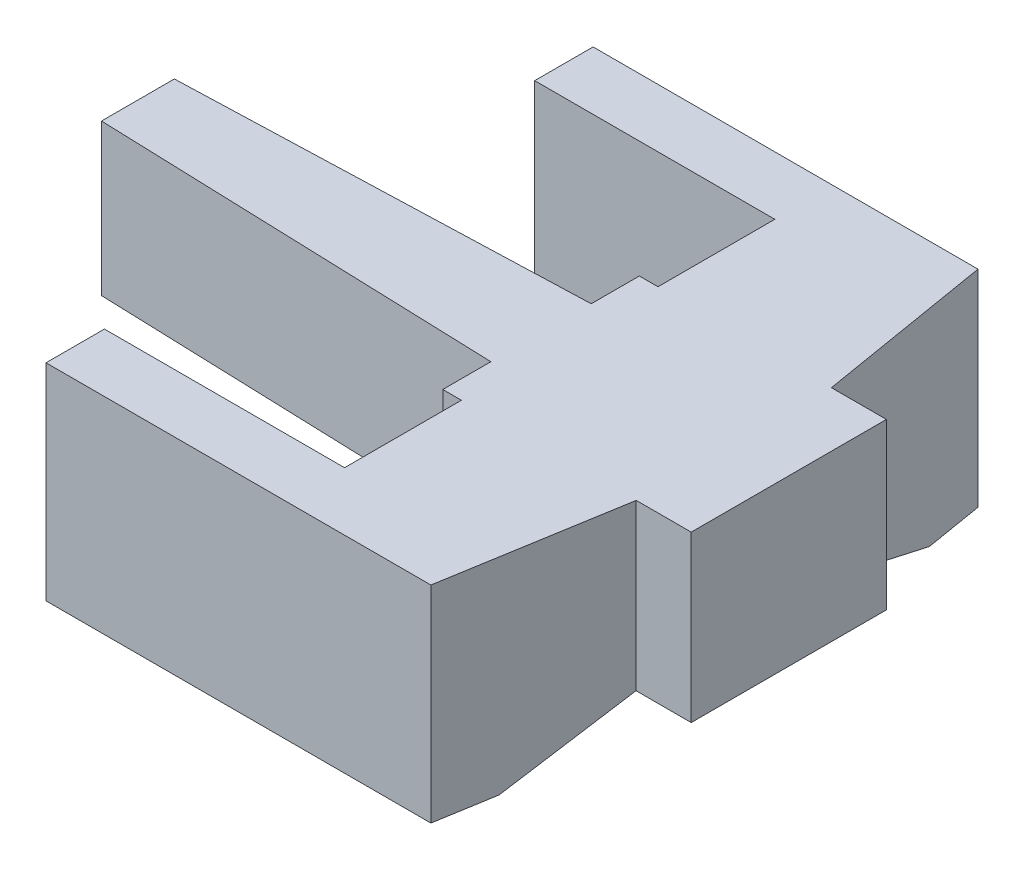
ISO-10303-21;
HEADER;
FILE_DESCRIPTION(('STEP AP214'),'2;1');
FILE_NAME('part.step','',(''),(''),'','','');
FILE_SCHEMA(('AUTOMOTIVE_DESIGN { 1 0 10303 214 1 1 1 1 }'));
ENDSEC;
DATA;
#1=APPLICATION_CONTEXT('core data for automotive mechanical design processes');
#2=APPLICATION_PROTOCOL_DEFINITION('international standard','automotive_design',2000,#1);
#3=PRODUCT_CONTEXT('',#1,'mechanical');
#4=PRODUCT('Part','Part','',(#3));
#5=PRODUCT_RELATED_PRODUCT_CATEGORY('part','',(#4));
#6=PRODUCT_DEFINITION_FORMATION('','',#4);
#7=PRODUCT_DEFINITION_CONTEXT('part definition',#1,'design');
#8=PRODUCT_DEFINITION('design','',#6,#7);
#9=PRODUCT_DEFINITION_SHAPE('','',#8);
#10=(LENGTH_UNIT() NAMED_UNIT(*) SI_UNIT(.MILLI.,.METRE.));
#11=(NAMED_UNIT(*) PLANE_ANGLE_UNIT() SI_UNIT($,.RADIAN.));
#12=(NAMED_UNIT(*) SI_UNIT($,.STERADIAN.) SOLID_ANGLE_UNIT());
#13=UNCERTAINTY_MEASURE_WITH_UNIT(LENGTH_MEASURE(1.E-05),#10,'distance_accuracy_value','');
#14=(GEOMETRIC_REPRESENTATION_CONTEXT(3) GLOBAL_UNCERTAINTY_ASSIGNED_CONTEXT((#13)) GLOBAL_UNIT_ASSIGNED_CONTEXT((#10,
#11,#12)) REPRESENTATION_CONTEXT('',''));
#15=CARTESIAN_POINT('',(0.,0.,0.));
#16=DIRECTION('',(0.,0.,1.));
#17=DIRECTION('',(1.,0.,0.));
#18=AXIS2_PLACEMENT_3D('',#15,#16,#17);
#19=CARTESIAN_POINT('',(12.0186614655194,15.,-76.3129094407043));
#20=DIRECTION('',(0.0340792834650468,0.,0.999419132515737));
#21=DIRECTION('',(0.999419132515737,0.,-0.0340792834650468));
#22=AXIS2_PLACEMENT_3D('',#19,#20,#21);
#23=PLANE('',#22);
#24=DIRECTION('',(0.999419132515737,0.,-0.0340792834650468));
#25=VECTOR('',#24,1.);
#26=CARTESIAN_POINT('',(41.3449568244222,4.,-77.3129094407043));
#27=LINE('',#26,#25);
#28=CARTESIAN_POINT('',(12.0186614655194,4.,-76.3129094407043));
#29=VERTEX_POINT('',#28);
#30=CARTESIAN_POINT('',(41.3449568244222,4.,-77.3129094407043));
#31=VERTEX_POINT('',#30);
#32=EDGE_CURVE('E392',#29,#31,#27,.T.);
#33=ORIENTED_EDGE('',*,*,#32,.F.);
#34=DIRECTION('',(0.,-1.,0.));
#35=VECTOR('',#34,1.);
#36=CARTESIAN_POINT('',(12.0186614655194,15.,-76.3129094407043));
#37=LINE('',#36,#35);
#38=CARTESIAN_POINT('',(12.0186614655194,15.,-76.3129094407043));
#39=VERTEX_POINT('',#38);
#40=EDGE_CURVE('E218',#39,#29,#37,.T.);
#41=ORIENTED_EDGE('',*,*,#40,.F.);
#42=DIRECTION('',(-0.999419132515737,0.,0.0340792834650468));
#43=VECTOR('',#42,1.);
#44=CARTESIAN_POINT('',(12.0186614655194,15.,-76.3129094407043));
#45=LINE('',#44,#43);
#46=CARTESIAN_POINT('',(41.3449568244222,15.,-77.3129094407043));
#47=VERTEX_POINT('',#46);
#48=EDGE_CURVE('E302',#47,#39,#45,.T.);
#49=ORIENTED_EDGE('',*,*,#48,.F.);
#50=DIRECTION('',(0.,-1.,0.));
#51=VECTOR('',#50,1.);
#52=CARTESIAN_POINT('',(41.3449568244222,15.,-77.3129094407043));
#53=LINE('',#52,#51);
#54=EDGE_CURVE('E221',#47,#31,#53,.T.);
#55=ORIENTED_EDGE('',*,*,#54,.T.);
#56=EDGE_LOOP('',(#33,#41,#49,#55));
#57=FACE_BOUND('',#56,.T.);
#58=ADVANCED_FACE('F33',(#57),#23,.F.);
#59=CARTESIAN_POINT('',(12.0186614655193,15.,-71.0129094407043));
#60=DIRECTION('',(1.,0.,0.));
#61=DIRECTION('',(0.,0.,-1.));
#62=AXIS2_PLACEMENT_3D('',#59,#60,#61);
#63=PLANE('',#62);
#64=DIRECTION('',(0.,0.,-1.));
#65=VECTOR('',#64,1.);
#66=CARTESIAN_POINT('',(12.0186614655194,4.,-76.3129094407043));
#67=LINE('',#66,#65);
#68=CARTESIAN_POINT('',(12.0186614655193,4.,-71.0129094407043));
#69=VERTEX_POINT('',#68);
#70=EDGE_CURVE('E397',#69,#29,#67,.T.);
#71=ORIENTED_EDGE('',*,*,#70,.F.);
#72=DIRECTION('',(0.,-1.,0.));
#73=VECTOR('',#72,1.);
#74=CARTESIAN_POINT('',(12.0186614655193,15.,-71.0129094407043));
#75=LINE('',#74,#73);
#76=CARTESIAN_POINT('',(12.0186614655193,15.,-71.0129094407043));
#77=VERTEX_POINT('',#76);
#78=EDGE_CURVE('E215',#77,#69,#75,.T.);
#79=ORIENTED_EDGE('',*,*,#78,.F.);
#80=DIRECTION('',(0.,0.,1.));
#81=VECTOR('',#80,1.);
#82=CARTESIAN_POINT('',(12.0186614655193,15.,-71.0129094407043));
#83=LINE('',#82,#81);
#84=EDGE_CURVE('E304',#39,#77,#83,.T.);
#85=ORIENTED_EDGE('',*,*,#84,.F.);
#86=ORIENTED_EDGE('',*,*,#40,.T.);
#87=EDGE_LOOP('',(#71,#79,#85,#86));
#88=FACE_BOUND('',#87,.T.);
#89=ADVANCED_FACE('F469',(#88),#63,.F.);
#90=CARTESIAN_POINT('',(41.3449568244222,15.,-70.0129094407043));
#91=DIRECTION('',(0.0340792834650473,0.,-0.999419132515737));
#92=DIRECTION('',(-0.999419132515737,0.,-0.0340792834650473));
#93=AXIS2_PLACEMENT_3D('',#90,#91,#92);
#94=PLANE('',#93);
#95=DIRECTION('',(-0.999419132515737,0.,-0.0340792834650473));
#96=VECTOR('',#95,1.);
#97=CARTESIAN_POINT('',(12.0186614655193,4.,-71.0129094407043));
#98=LINE('',#97,#96);
#99=CARTESIAN_POINT('',(41.3449568244222,4.,-70.0129094407043));
#100=VERTEX_POINT('',#99);
#101=EDGE_CURVE('E421',#100,#69,#98,.T.);
#102=ORIENTED_EDGE('',*,*,#101,.F.);
#103=DIRECTION('',(0.,-1.,0.));
#104=VECTOR('',#103,1.);
#105=CARTESIAN_POINT('',(41.3449568244222,15.,-70.0129094407043));
#106=LINE('',#105,#104);
#107=CARTESIAN_POINT('',(41.3449568244222,15.,-70.0129094407043));
#108=VERTEX_POINT('',#107);
#109=EDGE_CURVE('E212',#108,#100,#106,.T.);
#110=ORIENTED_EDGE('',*,*,#109,.F.);
#111=DIRECTION('',(0.999419132515737,0.,0.0340792834650473));
#112=VECTOR('',#111,1.);
#113=CARTESIAN_POINT('',(41.3449568244222,15.,-70.0129094407043));
#114=LINE('',#113,#112);
#115=EDGE_CURVE('E306',#77,#108,#114,.T.);
#116=ORIENTED_EDGE('',*,*,#115,.F.);
#117=ORIENTED_EDGE('',*,*,#78,.T.);
#118=EDGE_LOOP('',(#102,#110,#116,#117));
#119=FACE_BOUND('',#118,.T.);
#120=ADVANCED_FACE('F471',(#119),#94,.F.);
#121=CARTESIAN_POINT('',(41.3449568244222,15.,-80.8129094407043));
#122=DIRECTION('',(0.,0.,1.));
#123=DIRECTION('',(1.,0.,0.));
#124=AXIS2_PLACEMENT_3D('',#121,#122,#123);
#125=PLANE('',#124);
#126=DIRECTION('',(1.,0.,0.));
#127=VECTOR('',#126,1.);
#128=CARTESIAN_POINT('',(42.7011333168489,3.,-80.8129094407043));
#129=LINE('',#128,#127);
#130=CARTESIAN_POINT('',(41.3449568244222,3.,-80.8129094407043));
#131=VERTEX_POINT('',#130);
#132=CARTESIAN_POINT('',(42.7011333168488,3.,-80.8129094407043));
#133=VERTEX_POINT('',#132);
#134=EDGE_CURVE('E269',#131,#133,#129,.T.);
#135=ORIENTED_EDGE('',*,*,#134,.F.);
#136=DIRECTION('',(0.,-1.,0.));
#137=VECTOR('',#136,1.);
#138=CARTESIAN_POINT('',(41.3449568244222,15.,-80.8129094407043));
#139=LINE('',#138,#137);
#140=CARTESIAN_POINT('',(41.3449568244222,15.,-80.8129094407043));
#141=VERTEX_POINT('',#140);
#142=EDGE_CURVE('E224',#141,#131,#139,.T.);
#143=ORIENTED_EDGE('',*,*,#142,.F.);
#144=DIRECTION('',(-1.,0.,0.));
#145=VECTOR('',#144,1.);
#146=CARTESIAN_POINT('',(41.3449568244222,15.,-80.8129094407043));
#147=LINE('',#146,#145);
#148=CARTESIAN_POINT('',(42.7011333168489,15.,-80.8129094407043));
#149=VERTEX_POINT('',#148);
#150=EDGE_CURVE('E298',#149,#141,#147,.T.);
#151=ORIENTED_EDGE('',*,*,#150,.F.);
#152=DIRECTION('',(0.,-1.,0.));
#153=VECTOR('',#152,1.);
#154=CARTESIAN_POINT('',(42.7011333168489,15.,-80.8129094407043));
#155=LINE('',#154,#153);
#156=EDGE_CURVE('E227',#149,#133,#155,.T.);
#157=ORIENTED_EDGE('',*,*,#156,.T.);
#158=EDGE_LOOP('',(#135,#143,#151,#157));
#159=FACE_BOUND('',#158,.T.);
#160=ADVANCED_FACE('F407',(#159),#125,.F.);
#161=CARTESIAN_POINT('',(41.3449568244222,15.,-77.3129094407043));
#162=DIRECTION('',(1.,0.,0.));
#163=DIRECTION('',(0.,0.,-1.));
#164=AXIS2_PLACEMENT_3D('',#161,#162,#163);
#165=PLANE('',#164);
#166=DIRECTION('',(0.,0.,-1.));
#167=VECTOR('',#166,1.);
#168=CARTESIAN_POINT('',(41.3449568244222,3.,-77.3129094407043));
#169=LINE('',#168,#167);
#170=CARTESIAN_POINT('',(41.3449568244222,3.,-75.763096413664));
#171=VERTEX_POINT('',#170);
#172=EDGE_CURVE('E282',#171,#131,#169,.T.);
#173=ORIENTED_EDGE('',*,*,#172,.F.);
#174=DIRECTION('',(0.,-1.,0.));
#175=VECTOR('',#174,1.);
#176=CARTESIAN_POINT('',(41.3449568244222,4.,-75.763096413664));
#177=LINE('',#176,#175);
#178=CARTESIAN_POINT('',(41.3449568244222,4.,-75.763096413664));
#179=VERTEX_POINT('',#178);
#180=EDGE_CURVE('E387',#179,#171,#177,.T.);
#181=ORIENTED_EDGE('',*,*,#180,.F.);
#182=DIRECTION('',(0.,0.,1.));
#183=VECTOR('',#182,1.);
#184=CARTESIAN_POINT('',(41.3449568244222,4.,-77.3129094407043));
#185=LINE('',#184,#183);
#186=EDGE_CURVE('E381',#31,#179,#185,.T.);
#187=ORIENTED_EDGE('',*,*,#186,.F.);
#188=ORIENTED_EDGE('',*,*,#54,.F.);
#189=DIRECTION('',(0.,0.,1.));
#190=VECTOR('',#189,1.);
#191=CARTESIAN_POINT('',(41.3449568244222,15.,-77.3129094407043));
#192=LINE('',#191,#190);
#193=EDGE_CURVE('E300',#141,#47,#192,.T.);
#194=ORIENTED_EDGE('',*,*,#193,.F.);
#195=ORIENTED_EDGE('',*,*,#142,.T.);
#196=EDGE_LOOP('',(#173,#181,#187,#188,#194,#195));
#197=FACE_BOUND('',#196,.T.);
#198=ADVANCED_FACE('F383',(#197),#165,.F.);
#199=CARTESIAN_POINT('',(41.3449568244222,15.,-66.5129094407043));
#200=DIRECTION('',(1.,0.,0.));
#201=DIRECTION('',(0.,0.,-1.));
#202=AXIS2_PLACEMENT_3D('',#199,#200,#201);
#203=PLANE('',#202);
#204=DIRECTION('',(0.,0.,-1.));
#205=VECTOR('',#204,1.);
#206=CARTESIAN_POINT('',(41.3449568244222,3.,-66.5129094407043));
#207=LINE('',#206,#205);
#208=CARTESIAN_POINT('',(41.3449568244222,3.,-66.5129094407039));
#209=VERTEX_POINT('',#208);
#210=CARTESIAN_POINT('',(41.3449568244222,3.,-71.5627224677447));
#211=VERTEX_POINT('',#210);
#212=EDGE_CURVE('E276',#209,#211,#207,.T.);
#213=ORIENTED_EDGE('',*,*,#212,.F.);
#214=DIRECTION('',(0.,-1.,0.));
#215=VECTOR('',#214,1.);
#216=CARTESIAN_POINT('',(41.3449568244222,15.,-66.5129094407043));
#217=LINE('',#216,#215);
#218=CARTESIAN_POINT('',(41.3449568244222,15.,-66.5129094407043));
#219=VERTEX_POINT('',#218);
#220=EDGE_CURVE('E209',#219,#209,#217,.T.);
#221=ORIENTED_EDGE('',*,*,#220,.F.);
#222=DIRECTION('',(0.,0.,1.));
#223=VECTOR('',#222,1.);
#224=CARTESIAN_POINT('',(41.3449568244222,15.,-66.5129094407043));
#225=LINE('',#224,#223);
#226=EDGE_CURVE('E308',#108,#219,#225,.T.);
#227=ORIENTED_EDGE('',*,*,#226,.F.);
#228=ORIENTED_EDGE('',*,*,#109,.T.);
#229=DIRECTION('',(0.,0.,1.));
#230=VECTOR('',#229,1.);
#231=CARTESIAN_POINT('',(41.3449568244222,4.,-70.0129094407043));
#232=LINE('',#231,#230);
#233=CARTESIAN_POINT('',(41.3449568244222,4.,-71.5627224677447));
#234=VERTEX_POINT('',#233);
#235=EDGE_CURVE('E461',#234,#100,#232,.T.);
#236=ORIENTED_EDGE('',*,*,#235,.F.);
#237=DIRECTION('',(0.,-1.,0.));
#238=VECTOR('',#237,1.);
#239=CARTESIAN_POINT('',(41.3449568244222,4.,-71.5627224677447));
#240=LINE('',#239,#238);
#241=EDGE_CURVE('E416',#234,#211,#240,.T.);
#242=ORIENTED_EDGE('',*,*,#241,.T.);
#243=EDGE_LOOP('',(#213,#221,#227,#228,#236,#242));
#244=FACE_BOUND('',#243,.T.);
#245=ADVANCED_FACE('F459',(#244),#203,.F.);
#246=CARTESIAN_POINT('',(59.3686614655194,15.,-66.5629094407043));
#247=DIRECTION('',(0.,0.,-1.));
#248=DIRECTION('',(-1.,0.,0.));
#249=AXIS2_PLACEMENT_3D('',#246,#247,#248);
#250=PLANE('',#249);
#251=DIRECTION('',(-1.,0.,0.));
#252=VECTOR('',#251,1.);
#253=CARTESIAN_POINT('',(59.3686614655194,3.,-66.5629094407043));
#254=LINE('',#253,#252);
#255=CARTESIAN_POINT('',(59.3686614655194,3.,-66.5629094407043));
#256=VERTEX_POINT('',#255);
#257=CARTESIAN_POINT('',(55.3686614655194,3.,-66.5629094407043));
#258=VERTEX_POINT('',#257);
#259=EDGE_CURVE('E285',#256,#258,#254,.T.);
#260=ORIENTED_EDGE('',*,*,#259,.F.);
#261=DIRECTION('',(0.,-1.,0.));
#262=VECTOR('',#261,1.);
#263=CARTESIAN_POINT('',(59.3686614655194,15.,-66.5629094407043));
#264=LINE('',#263,#262);
#265=CARTESIAN_POINT('',(59.3686614655194,15.,-66.5629094407043));
#266=VERTEX_POINT('',#265);
#267=EDGE_CURVE('E161',#266,#256,#264,.T.);
#268=ORIENTED_EDGE('',*,*,#267,.F.);
#269=DIRECTION('',(1.,0.,0.));
#270=VECTOR('',#269,1.);
#271=CARTESIAN_POINT('',(59.3686614655194,15.,-66.5629094407043));
#272=LINE('',#271,#270);
#273=CARTESIAN_POINT('',(55.3686614655194,15.,-66.5629094407043));
#274=VERTEX_POINT('',#273);
#275=EDGE_CURVE('E147',#274,#266,#272,.T.);
#276=ORIENTED_EDGE('',*,*,#275,.F.);
#277=DIRECTION('',(0.,-1.,0.));
#278=VECTOR('',#277,1.);
#279=CARTESIAN_POINT('',(55.3686614655194,15.,-66.5629094407043));
#280=LINE('',#279,#278);
#281=EDGE_CURVE('E193',#274,#258,#280,.T.);
#282=ORIENTED_EDGE('',*,*,#281,.T.);
#283=EDGE_LOOP('',(#260,#268,#276,#282));
#284=FACE_BOUND('',#283,.T.);
#285=ADVANCED_FACE('F330',(#284),#250,.F.);
#286=CARTESIAN_POINT('',(59.3686614655194,15.,-80.7629094407043));
#287=DIRECTION('',(-1.,0.,0.));
#288=DIRECTION('',(0.,0.,1.));
#289=AXIS2_PLACEMENT_3D('',#286,#287,#288);
#290=PLANE('',#289);
#291=DIRECTION('',(0.,0.,1.));
#292=VECTOR('',#291,1.);
#293=CARTESIAN_POINT('',(59.3686614655194,3.,-80.7629094407043));
#294=LINE('',#293,#292);
#295=CARTESIAN_POINT('',(59.3686614655194,3.,-80.7629094407043));
#296=VERTEX_POINT('',#295);
#297=EDGE_CURVE('E158',#296,#256,#294,.T.);
#298=ORIENTED_EDGE('',*,*,#297,.F.);
#299=DIRECTION('',(0.,-1.,0.));
#300=VECTOR('',#299,1.);
#301=CARTESIAN_POINT('',(59.3686614655194,15.,-80.7629094407043));
#302=LINE('',#301,#300);
#303=CARTESIAN_POINT('',(59.3686614655194,15.,-80.7629094407043));
#304=VERTEX_POINT('',#303);
#305=EDGE_CURVE('E154',#304,#296,#302,.T.);
#306=ORIENTED_EDGE('',*,*,#305,.F.);
#307=DIRECTION('',(0.,0.,-1.));
#308=VECTOR('',#307,1.);
#309=CARTESIAN_POINT('',(59.3686614655194,15.,-80.7629094407043));
#310=LINE('',#309,#308);
#311=EDGE_CURVE('E140',#266,#304,#310,.T.);
#312=ORIENTED_EDGE('',*,*,#311,.F.);
#313=ORIENTED_EDGE('',*,*,#267,.T.);
#314=EDGE_LOOP('',(#298,#306,#312,#313));
#315=FACE_BOUND('',#314,.T.);
#316=ADVANCED_FACE('F155',(#315),#290,.F.);
#317=CARTESIAN_POINT('',(55.3686614655194,15.,-80.7629094407043));
#318=DIRECTION('',(0.,0.,1.));
#319=DIRECTION('',(1.,0.,0.));
#320=AXIS2_PLACEMENT_3D('',#317,#318,#319);
#321=PLANE('',#320);
#322=DIRECTION('',(1.,0.,0.));
#323=VECTOR('',#322,1.);
#324=CARTESIAN_POINT('',(55.3686614655194,3.,-80.7629094407043));
#325=LINE('',#324,#323);
#326=CARTESIAN_POINT('',(55.3686614655194,3.,-80.7629094407043));
#327=VERTEX_POINT('',#326);
#328=EDGE_CURVE('E272',#327,#296,#325,.T.);
#329=ORIENTED_EDGE('',*,*,#328,.F.);
#330=DIRECTION('',(0.,-1.,0.));
#331=VECTOR('',#330,1.);
#332=CARTESIAN_POINT('',(55.3686614655194,15.,-80.7629094407043));
#333=LINE('',#332,#331);
#334=CARTESIAN_POINT('',(55.3686614655194,15.,-80.7629094407043));
#335=VERTEX_POINT('',#334);
#336=EDGE_CURVE('E162',#335,#327,#333,.T.);
#337=ORIENTED_EDGE('',*,*,#336,.F.);
#338=DIRECTION('',(-1.,0.,0.));
#339=VECTOR('',#338,1.);
#340=CARTESIAN_POINT('',(55.3686614655194,15.,-80.7629094407043));
#341=LINE('',#340,#339);
#342=EDGE_CURVE('E144',#304,#335,#341,.T.);
#343=ORIENTED_EDGE('',*,*,#342,.F.);
#344=ORIENTED_EDGE('',*,*,#305,.T.);
#345=EDGE_LOOP('',(#329,#337,#343,#344));
#346=FACE_BOUND('',#345,.T.);
#347=ADVANCED_FACE('F164',(#346),#321,.F.);
#348=CARTESIAN_POINT('',(0.,0.,0.));
#349=DIRECTION('',(0.,-1.,0.));
#350=DIRECTION('',(0.,0.,-1.));
#351=AXIS2_PLACEMENT_3D('',#348,#349,#350);
#352=PLANE('',#351);
#353=DIRECTION('',(-1.,0.,0.));
#354=VECTOR('',#353,1.);
#355=CARTESIAN_POINT('',(62.7011333168488,0.,-58.0129094407043));
#356=LINE('',#355,#354);
#357=CARTESIAN_POINT('',(53.9410675911786,0.,-58.0129094407043));
#358=VERTEX_POINT('',#357);
#359=CARTESIAN_POINT('',(42.7011333168488,0.,-58.0129094407043));
#360=VERTEX_POINT('',#359);
#361=EDGE_CURVE('E426',#358,#360,#356,.T.);
#362=ORIENTED_EDGE('',*,*,#361,.F.);
#363=DIRECTION('',(0.164690127331617,0.,-0.98634535633291));
#364=VECTOR('',#363,1.);
#365=CARTESIAN_POINT('',(55.3686614655194,0.,-66.5629094407043));
#366=LINE('',#365,#364);
#367=CARTESIAN_POINT('',(53.2314449051028,0.,-53.7629094407043));
#368=VERTEX_POINT('',#367);
#369=EDGE_CURVE('E185',#368,#358,#366,.T.);
#370=ORIENTED_EDGE('',*,*,#369,.F.);
#371=DIRECTION('',(1.,0.,0.));
#372=VECTOR('',#371,1.);
#373=CARTESIAN_POINT('',(53.2314449051028,0.,-53.7629094407043));
#374=LINE('',#373,#372);
#375=CARTESIAN_POINT('',(25.2314449051028,0.,-53.7629094407043));
#376=VERTEX_POINT('',#375);
#377=EDGE_CURVE('E74',#376,#368,#374,.T.);
#378=ORIENTED_EDGE('',*,*,#377,.F.);
#379=DIRECTION('',(0.,0.,1.));
#380=VECTOR('',#379,1.);
#381=CARTESIAN_POINT('',(25.2314449051028,0.,-53.7629094407043));
#382=LINE('',#381,#380);
#383=CARTESIAN_POINT('',(25.2314449051028,0.,-58.0129094407043));
#384=VERTEX_POINT('',#383);
#385=EDGE_CURVE('E182',#384,#376,#382,.T.);
#386=ORIENTED_EDGE('',*,*,#385,.F.);
#387=DIRECTION('',(-1.,0.,0.));
#388=VECTOR('',#387,1.);
#389=CARTESIAN_POINT('',(25.2314449051028,0.,-58.0129094407043));
#390=LINE('',#389,#388);
#391=EDGE_CURVE('E180',#360,#384,#390,.T.);
#392=ORIENTED_EDGE('',*,*,#391,.F.);
#393=EDGE_LOOP('',(#362,#370,#378,#386,#392));
#394=FACE_BOUND('',#393,.T.);
#395=ADVANCED_FACE('F438',(#394),#352,.T.);
#396=CARTESIAN_POINT('',(25.2314449051028,15.,-93.5629094407043));
#397=DIRECTION('',(0.,0.,1.));
#398=DIRECTION('',(1.,0.,0.));
#399=AXIS2_PLACEMENT_3D('',#396,#397,#398);
#400=PLANE('',#399);
#401=DIRECTION('',(-1.,0.,0.));
#402=VECTOR('',#401,1.);
#403=CARTESIAN_POINT('',(25.2314449051028,0.,-93.5629094407043));
#404=LINE('',#403,#402);
#405=CARTESIAN_POINT('',(53.2314449051028,0.,-93.5629094407043));
#406=VERTEX_POINT('',#405);
#407=CARTESIAN_POINT('',(25.2314449051028,0.,-93.5629094407043));
#408=VERTEX_POINT('',#407);
#409=EDGE_CURVE('E171',#406,#408,#404,.T.);
#410=ORIENTED_EDGE('',*,*,#409,.T.);
#411=DIRECTION('',(0.,-1.,0.));
#412=VECTOR('',#411,1.);
#413=CARTESIAN_POINT('',(25.2314449051028,15.,-93.5629094407043));
#414=LINE('',#413,#412);
#415=CARTESIAN_POINT('',(25.2314449051028,15.,-93.5629094407043));
#416=VERTEX_POINT('',#415);
#417=EDGE_CURVE('E11',#416,#408,#414,.T.);
#418=ORIENTED_EDGE('',*,*,#417,.F.);
#419=DIRECTION('',(-1.,0.,0.));
#420=VECTOR('',#419,1.);
#421=CARTESIAN_POINT('',(25.2314449051028,15.,-93.5629094407043));
#422=LINE('',#421,#420);
#423=CARTESIAN_POINT('',(53.2314449051028,15.,-93.5629094407043));
#424=VERTEX_POINT('',#423);
#425=EDGE_CURVE('E189',#424,#416,#422,.T.);
#426=ORIENTED_EDGE('',*,*,#425,.F.);
#427=DIRECTION('',(0.,-1.,0.));
#428=VECTOR('',#427,1.);
#429=CARTESIAN_POINT('',(53.2314449051028,15.,-93.5629094407043));
#430=LINE('',#429,#428);
#431=EDGE_CURVE('E167',#424,#406,#430,.T.);
#432=ORIENTED_EDGE('',*,*,#431,.T.);
#433=EDGE_LOOP('',(#410,#418,#426,#432));
#434=FACE_BOUND('',#433,.T.);
#435=ADVANCED_FACE('F35',(#434),#400,.F.);
#436=CARTESIAN_POINT('',(25.2314449051028,15.,-89.3129094407043));
#437=DIRECTION('',(1.,0.,0.));
#438=DIRECTION('',(0.,0.,-1.));
#439=AXIS2_PLACEMENT_3D('',#436,#437,#438);
#440=PLANE('',#439);
#441=DIRECTION('',(0.,0.,1.));
#442=VECTOR('',#441,1.);
#443=CARTESIAN_POINT('',(25.2314449051028,0.,-89.3129094407043));
#444=LINE('',#443,#442);
#445=CARTESIAN_POINT('',(25.2314449051028,0.,-89.3129094407043));
#446=VERTEX_POINT('',#445);
#447=EDGE_CURVE('E174',#408,#446,#444,.T.);
#448=ORIENTED_EDGE('',*,*,#447,.T.);
#449=DIRECTION('',(0.,-1.,0.));
#450=VECTOR('',#449,1.);
#451=CARTESIAN_POINT('',(25.2314449051028,15.,-89.3129094407043));
#452=LINE('',#451,#450);
#453=CARTESIAN_POINT('',(25.2314449051028,15.,-89.3129094407043));
#454=VERTEX_POINT('',#453);
#455=EDGE_CURVE('E42',#454,#446,#452,.T.);
#456=ORIENTED_EDGE('',*,*,#455,.F.);
#457=DIRECTION('',(0.,0.,1.));
#458=VECTOR('',#457,1.);
#459=CARTESIAN_POINT('',(25.2314449051028,15.,-89.3129094407043));
#460=LINE('',#459,#458);
#461=EDGE_CURVE('E89',#416,#454,#460,.T.);
#462=ORIENTED_EDGE('',*,*,#461,.F.);
#463=ORIENTED_EDGE('',*,*,#417,.T.);
#464=EDGE_LOOP('',(#448,#456,#462,#463));
#465=FACE_BOUND('',#464,.T.);
#466=ADVANCED_FACE('F493',(#465),#440,.F.);
#467=CARTESIAN_POINT('',(42.7011333168488,15.,-89.3129094407043));
#468=DIRECTION('',(0.,0.,-1.));
#469=DIRECTION('',(-1.,0.,0.));
#470=AXIS2_PLACEMENT_3D('',#467,#468,#469);
#471=PLANE('',#470);
#472=DIRECTION('',(1.,0.,0.));
#473=VECTOR('',#472,1.);
#474=CARTESIAN_POINT('',(42.7011333168488,0.,-89.3129094407043));
#475=LINE('',#474,#473);
#476=CARTESIAN_POINT('',(42.7011333168488,0.,-89.3129094407043));
#477=VERTEX_POINT('',#476);
#478=EDGE_CURVE('E177',#446,#477,#475,.T.);
#479=ORIENTED_EDGE('',*,*,#478,.T.);
#480=DIRECTION('',(0.,-1.,0.));
#481=VECTOR('',#480,1.);
#482=CARTESIAN_POINT('',(42.7011333168488,15.,-89.3129094407043));
#483=LINE('',#482,#481);
#484=CARTESIAN_POINT('',(42.7011333168488,15.,-89.3129094407043));
#485=VERTEX_POINT('',#484);
#486=EDGE_CURVE('E230',#485,#477,#483,.T.);
#487=ORIENTED_EDGE('',*,*,#486,.F.);
#488=DIRECTION('',(1.,0.,0.));
#489=VECTOR('',#488,1.);
#490=CARTESIAN_POINT('',(42.7011333168488,15.,-89.3129094407043));
#491=LINE('',#490,#489);
#492=EDGE_CURVE('E239',#454,#485,#491,.T.);
#493=ORIENTED_EDGE('',*,*,#492,.F.);
#494=ORIENTED_EDGE('',*,*,#455,.T.);
#495=EDGE_LOOP('',(#479,#487,#493,#494));
#496=FACE_BOUND('',#495,.T.);
#497=ADVANCED_FACE('F236',(#496),#471,.F.);
#498=CARTESIAN_POINT('',(42.7011333168489,15.,-80.8129094407043));
#499=DIRECTION('',(1.,0.,0.));
#500=DIRECTION('',(0.,0.,-1.));
#501=AXIS2_PLACEMENT_3D('',#498,#499,#500);
#502=PLANE('',#501);
#503=ORIENTED_EDGE('',*,*,#486,.T.);
#504=DIRECTION('',(0.,-0.332820117735138,-0.942990333582889));
#505=VECTOR('',#504,1.);
#506=CARTESIAN_POINT('',(42.7011333168488,3.,-80.8129094407043));
#507=LINE('',#506,#505);
#508=EDGE_CURVE('E254',#133,#477,#507,.T.);
#509=ORIENTED_EDGE('',*,*,#508,.F.);
#510=ORIENTED_EDGE('',*,*,#156,.F.);
#511=DIRECTION('',(0.,0.,1.));
#512=VECTOR('',#511,1.);
#513=CARTESIAN_POINT('',(42.7011333168489,15.,-80.8129094407043));
#514=LINE('',#513,#512);
#515=EDGE_CURVE('E296',#485,#149,#514,.T.);
#516=ORIENTED_EDGE('',*,*,#515,.F.);
#517=EDGE_LOOP('',(#503,#509,#510,#516));
#518=FACE_BOUND('',#517,.T.);
#519=ADVANCED_FACE('F488',(#518),#502,.F.);
#520=CARTESIAN_POINT('',(42.7011333168488,15.,-66.5129094407043));
#521=DIRECTION('',(0.,0.,-1.));
#522=DIRECTION('',(-1.,0.,0.));
#523=AXIS2_PLACEMENT_3D('',#520,#521,#522);
#524=PLANE('',#523);
#525=ORIENTED_EDGE('',*,*,#220,.T.);
#526=DIRECTION('',(-1.,0.,0.));
#527=VECTOR('',#526,1.);
#528=CARTESIAN_POINT('',(41.3449568244222,3.,-66.5129094407039));
#529=LINE('',#528,#527);
#530=CARTESIAN_POINT('',(42.7011333168488,3.,-66.5129094407039));
#531=VERTEX_POINT('',#530);
#532=EDGE_CURVE('E266',#531,#209,#529,.T.);
#533=ORIENTED_EDGE('',*,*,#532,.F.);
#534=DIRECTION('',(0.,-1.,0.));
#535=VECTOR('',#534,1.);
#536=CARTESIAN_POINT('',(42.7011333168488,15.,-66.5129094407043));
#537=LINE('',#536,#535);
#538=CARTESIAN_POINT('',(42.7011333168488,15.,-66.5129094407043));
#539=VERTEX_POINT('',#538);
#540=EDGE_CURVE('E206',#539,#531,#537,.T.);
#541=ORIENTED_EDGE('',*,*,#540,.F.);
#542=DIRECTION('',(1.,0.,0.));
#543=VECTOR('',#542,1.);
#544=CARTESIAN_POINT('',(42.7011333168488,15.,-66.5129094407043));
#545=LINE('',#544,#543);
#546=EDGE_CURVE('E310',#219,#539,#545,.T.);
#547=ORIENTED_EDGE('',*,*,#546,.F.);
#548=EDGE_LOOP('',(#525,#533,#541,#547));
#549=FACE_BOUND('',#548,.T.);
#550=ADVANCED_FACE('F456',(#549),#524,.F.);
#551=CARTESIAN_POINT('',(42.7011333168488,15.,-58.0129094407043));
#552=DIRECTION('',(1.,0.,0.));
#553=DIRECTION('',(0.,0.,-1.));
#554=AXIS2_PLACEMENT_3D('',#551,#552,#553);
#555=PLANE('',#554);
#556=ORIENTED_EDGE('',*,*,#540,.T.);
#557=DIRECTION('',(0.,0.332820117735152,-0.942990333582884));
#558=VECTOR('',#557,1.);
#559=CARTESIAN_POINT('',(42.7011333168488,3.,-66.5129094407039));
#560=LINE('',#559,#558);
#561=EDGE_CURVE('E419',#360,#531,#560,.T.);
#562=ORIENTED_EDGE('',*,*,#561,.F.);
#563=DIRECTION('',(0.,-1.,0.));
#564=VECTOR('',#563,1.);
#565=CARTESIAN_POINT('',(42.7011333168488,15.,-58.0129094407043));
#566=LINE('',#565,#564);
#567=CARTESIAN_POINT('',(42.7011333168488,15.,-58.0129094407043));
#568=VERTEX_POINT('',#567);
#569=EDGE_CURVE('E203',#568,#360,#566,.T.);
#570=ORIENTED_EDGE('',*,*,#569,.F.);
#571=DIRECTION('',(0.,0.,1.));
#572=VECTOR('',#571,1.);
#573=CARTESIAN_POINT('',(42.7011333168488,15.,-58.0129094407043));
#574=LINE('',#573,#572);
#575=EDGE_CURVE('E312',#539,#568,#574,.T.);
#576=ORIENTED_EDGE('',*,*,#575,.F.);
#577=EDGE_LOOP('',(#556,#562,#570,#576));
#578=FACE_BOUND('',#577,.T.);
#579=ADVANCED_FACE('F453',(#578),#555,.F.);
#580=CARTESIAN_POINT('',(25.2314449051028,15.,-58.0129094407043));
#581=DIRECTION('',(0.,0.,1.));
#582=DIRECTION('',(1.,0.,0.));
#583=AXIS2_PLACEMENT_3D('',#580,#581,#582);
#584=PLANE('',#583);
#585=ORIENTED_EDGE('',*,*,#391,.T.);
#586=DIRECTION('',(0.,-1.,0.));
#587=VECTOR('',#586,1.);
#588=CARTESIAN_POINT('',(25.2314449051028,15.,-58.0129094407043));
#589=LINE('',#588,#587);
#590=CARTESIAN_POINT('',(25.2314449051028,15.,-58.0129094407043));
#591=VERTEX_POINT('',#590);
#592=EDGE_CURVE('E200',#591,#384,#589,.T.);
#593=ORIENTED_EDGE('',*,*,#592,.F.);
#594=DIRECTION('',(-1.,0.,0.));
#595=VECTOR('',#594,1.);
#596=CARTESIAN_POINT('',(25.2314449051028,15.,-58.0129094407043));
#597=LINE('',#596,#595);
#598=EDGE_CURVE('E314',#568,#591,#597,.T.);
#599=ORIENTED_EDGE('',*,*,#598,.F.);
#600=ORIENTED_EDGE('',*,*,#569,.T.);
#601=EDGE_LOOP('',(#585,#593,#599,#600));
#602=FACE_BOUND('',#601,.T.);
#603=ADVANCED_FACE('F442',(#602),#584,.F.);
#604=CARTESIAN_POINT('',(25.2314449051028,15.,-53.7629094407043));
#605=DIRECTION('',(1.,0.,0.));
#606=DIRECTION('',(0.,0.,-1.));
#607=AXIS2_PLACEMENT_3D('',#604,#605,#606);
#608=PLANE('',#607);
#609=ORIENTED_EDGE('',*,*,#385,.T.);
#610=DIRECTION('',(0.,-1.,0.));
#611=VECTOR('',#610,1.);
#612=CARTESIAN_POINT('',(25.2314449051028,15.,-53.7629094407043));
#613=LINE('',#612,#611);
#614=CARTESIAN_POINT('',(25.2314449051028,15.,-53.7629094407043));
#615=VERTEX_POINT('',#614);
#616=EDGE_CURVE('E198',#615,#376,#613,.T.);
#617=ORIENTED_EDGE('',*,*,#616,.F.);
#618=DIRECTION('',(0.,0.,1.));
#619=VECTOR('',#618,1.);
#620=CARTESIAN_POINT('',(25.2314449051028,15.,-53.7629094407043));
#621=LINE('',#620,#619);
#622=EDGE_CURVE('E316',#591,#615,#621,.T.);
#623=ORIENTED_EDGE('',*,*,#622,.F.);
#624=ORIENTED_EDGE('',*,*,#592,.T.);
#625=EDGE_LOOP('',(#609,#617,#623,#624));
#626=FACE_BOUND('',#625,.T.);
#627=ADVANCED_FACE('F447',(#626),#608,.F.);
#628=CARTESIAN_POINT('',(53.2314449051028,15.,-53.7629094407043));
#629=DIRECTION('',(0.,0.,-1.));
#630=DIRECTION('',(-1.,0.,0.));
#631=AXIS2_PLACEMENT_3D('',#628,#629,#630);
#632=PLANE('',#631);
#633=ORIENTED_EDGE('',*,*,#377,.T.);
#634=DIRECTION('',(0.,-1.,0.));
#635=VECTOR('',#634,1.);
#636=CARTESIAN_POINT('',(53.2314449051028,15.,-53.7629094407043));
#637=LINE('',#636,#635);
#638=CARTESIAN_POINT('',(53.2314449051028,15.,-53.7629094407043));
#639=VERTEX_POINT('',#638);
#640=EDGE_CURVE('E196',#639,#368,#637,.T.);
#641=ORIENTED_EDGE('',*,*,#640,.F.);
#642=DIRECTION('',(1.,0.,0.));
#643=VECTOR('',#642,1.);
#644=CARTESIAN_POINT('',(53.2314449051028,15.,-53.7629094407043));
#645=LINE('',#644,#643);
#646=EDGE_CURVE('E318',#615,#639,#645,.T.);
#647=ORIENTED_EDGE('',*,*,#646,.F.);
#648=ORIENTED_EDGE('',*,*,#616,.T.);
#649=EDGE_LOOP('',(#633,#641,#647,#648));
#650=FACE_BOUND('',#649,.T.);
#651=ADVANCED_FACE('F536',(#650),#632,.F.);
#652=CARTESIAN_POINT('',(55.3686614655194,15.,-66.5629094407043));
#653=DIRECTION('',(-0.98634535633291,0.,-0.164690127331617));
#654=DIRECTION('',(-0.164690127331617,0.,0.986345356332911));
#655=AXIS2_PLACEMENT_3D('',#652,#653,#654);
#656=PLANE('',#655);
#657=DIRECTION('',(0.155535016690426,0.328769823194072,-0.931514499049826));
#658=VECTOR('',#657,1.);
#659=CARTESIAN_POINT('',(55.9813817185387,4.31281475507023,-70.232551246736));
#660=LINE('',#659,#658);
#661=CARTESIAN_POINT('',(55.3603129633302,3.,-66.5129094407039));
#662=VERTEX_POINT('',#661);
#663=EDGE_CURVE('E259',#358,#662,#660,.T.);
#664=ORIENTED_EDGE('',*,*,#663,.T.);
#665=DIRECTION('',(-0.164690127331617,0.,0.986345356332911));
#666=VECTOR('',#665,1.);
#667=CARTESIAN_POINT('',(55.3686614655194,3.,-66.5629094407043));
#668=LINE('',#667,#666);
#669=EDGE_CURVE('E288',#258,#662,#668,.T.);
#670=ORIENTED_EDGE('',*,*,#669,.F.);
#671=ORIENTED_EDGE('',*,*,#281,.F.);
#672=DIRECTION('',(0.164690127331617,0.,-0.98634535633291));
#673=VECTOR('',#672,1.);
#674=CARTESIAN_POINT('',(55.3686614655194,15.,-66.5629094407043));
#675=LINE('',#674,#673);
#676=EDGE_CURVE('E320',#639,#274,#675,.T.);
#677=ORIENTED_EDGE('',*,*,#676,.F.);
#678=ORIENTED_EDGE('',*,*,#640,.T.);
#679=ORIENTED_EDGE('',*,*,#369,.T.);
#680=EDGE_LOOP('',(#664,#670,#671,#677,#678,#679));
#681=FACE_BOUND('',#680,.T.);
#682=ADVANCED_FACE('F327',(#681),#656,.F.);
#683=CARTESIAN_POINT('',(53.2314449051028,15.,-93.5629094407043));
#684=DIRECTION('',(-0.98634535633291,0.,0.164690127331617));
#685=DIRECTION('',(0.164690127331617,0.,0.986345356332911));
#686=AXIS2_PLACEMENT_3D('',#683,#684,#685);
#687=PLANE('',#686);
#688=DIRECTION('',(-0.164690127331617,0.,-0.986345356332911));
#689=VECTOR('',#688,1.);
#690=CARTESIAN_POINT('',(53.2314449051028,3.,-93.5629094407043));
#691=LINE('',#690,#689);
#692=CARTESIAN_POINT('',(55.3603129633302,3.,-80.8129094407043));
#693=VERTEX_POINT('',#692);
#694=EDGE_CURVE('E257',#327,#693,#691,.T.);
#695=ORIENTED_EDGE('',*,*,#694,.T.);
#696=DIRECTION('',(-0.155535016690426,-0.328769823194058,-0.93151449904983));
#697=VECTOR('',#696,1.);
#698=CARTESIAN_POINT('',(54.0751760340764,0.283478344610354,-88.5097207976416));
#699=LINE('',#698,#697);
#700=CARTESIAN_POINT('',(53.9410675911786,0.,-89.3129094407043));
#701=VERTEX_POINT('',#700);
#702=EDGE_CURVE('E264',#693,#701,#699,.T.);
#703=ORIENTED_EDGE('',*,*,#702,.T.);
#704=DIRECTION('',(-0.164690127331617,0.,-0.98634535633291));
#705=VECTOR('',#704,1.);
#706=CARTESIAN_POINT('',(53.2314449051028,0.,-93.5629094407043));
#707=LINE('',#706,#705);
#708=EDGE_CURVE('E81',#701,#406,#707,.T.);
#709=ORIENTED_EDGE('',*,*,#708,.T.);
#710=ORIENTED_EDGE('',*,*,#431,.F.);
#711=DIRECTION('',(-0.164690127331617,0.,-0.98634535633291));
#712=VECTOR('',#711,1.);
#713=CARTESIAN_POINT('',(53.2314449051028,15.,-93.5629094407043));
#714=LINE('',#713,#712);
#715=EDGE_CURVE('E50',#335,#424,#714,.T.);
#716=ORIENTED_EDGE('',*,*,#715,.F.);
#717=ORIENTED_EDGE('',*,*,#336,.T.);
#718=EDGE_LOOP('',(#695,#703,#709,#710,#716,#717));
#719=FACE_BOUND('',#718,.T.);
#720=ADVANCED_FACE('F501',(#719),#687,.F.);
#721=CARTESIAN_POINT('',(0.,15.,0.));
#722=DIRECTION('',(0.,-1.,0.));
#723=DIRECTION('',(0.,0.,-1.));
#724=AXIS2_PLACEMENT_3D('',#721,#722,#723);
#725=PLANE('',#724);
#726=ORIENTED_EDGE('',*,*,#425,.T.);
#727=ORIENTED_EDGE('',*,*,#461,.T.);
#728=ORIENTED_EDGE('',*,*,#492,.T.);
#729=ORIENTED_EDGE('',*,*,#515,.T.);
#730=ORIENTED_EDGE('',*,*,#150,.T.);
#731=ORIENTED_EDGE('',*,*,#193,.T.);
#732=ORIENTED_EDGE('',*,*,#48,.T.);
#733=ORIENTED_EDGE('',*,*,#84,.T.);
#734=ORIENTED_EDGE('',*,*,#115,.T.);
#735=ORIENTED_EDGE('',*,*,#226,.T.);
#736=ORIENTED_EDGE('',*,*,#546,.T.);
#737=ORIENTED_EDGE('',*,*,#575,.T.);
#738=ORIENTED_EDGE('',*,*,#598,.T.);
#739=ORIENTED_EDGE('',*,*,#622,.T.);
#740=ORIENTED_EDGE('',*,*,#646,.T.);
#741=ORIENTED_EDGE('',*,*,#676,.T.);
#742=ORIENTED_EDGE('',*,*,#275,.T.);
#743=ORIENTED_EDGE('',*,*,#311,.T.);
#744=ORIENTED_EDGE('',*,*,#342,.T.);
#745=ORIENTED_EDGE('',*,*,#715,.T.);
#746=EDGE_LOOP('',(#726,#727,#728,#729,#730,#731,#732,#733,#734,#735,#736,#737,#738,#739,#740,
#741,#742,#743,#744,#745));
#747=FACE_BOUND('',#746,.T.);
#748=ADVANCED_FACE('F142',(#747),#725,.F.);
#749=DIRECTION('',(-1.,0.,0.));
#750=VECTOR('',#749,1.);
#751=CARTESIAN_POINT('',(62.7011333168488,0.,-89.3129094407043));
#752=LINE('',#751,#750);
#753=EDGE_CURVE('E245',#701,#477,#752,.T.);
#754=ORIENTED_EDGE('',*,*,#753,.T.);
#755=ORIENTED_EDGE('',*,*,#478,.F.);
#756=ORIENTED_EDGE('',*,*,#447,.F.);
#757=ORIENTED_EDGE('',*,*,#409,.F.);
#758=ORIENTED_EDGE('',*,*,#708,.F.);
#759=EDGE_LOOP('',(#754,#755,#756,#757,#758));
#760=FACE_BOUND('',#759,.T.);
#761=ADVANCED_FACE('F242',(#760),#352,.T.);
#762=CARTESIAN_POINT('',(42.7011333168489,-1.,-73.6629094407043));
#763=DIRECTION('',(0.,1.,0.));
#764=DIRECTION('',(0.,0.,1.));
#765=AXIS2_PLACEMENT_3D('',#762,#763,#764);
#766=CYLINDRICAL_SURFACE('',#765,2.5);
#767=CARTESIAN_POINT('',(42.7011333168489,-1.,-73.6629094407043));
#768=DIRECTION('',(0.,-1.,0.));
#769=DIRECTION('',(0.,0.,-1.));
#770=AXIS2_PLACEMENT_3D('',#767,#768,#769);
#771=CIRCLE('',#770,2.5);
#772=CARTESIAN_POINT('',(42.7011333168489,-1.,-76.1629094407043));
#773=VERTEX_POINT('',#772);
#774=EDGE_CURVE('E175',#773,#773,#771,.T.);
#775=ORIENTED_EDGE('',*,*,#774,.F.);
#776=EDGE_LOOP('',(#775));
#777=FACE_BOUND('',#776,.T.);
#778=CARTESIAN_POINT('',(42.7011333168489,3.,-73.6629094407043));
#779=DIRECTION('',(0.,1.,0.));
#780=DIRECTION('',(0.,0.,-1.));
#781=AXIS2_PLACEMENT_3D('',#778,#779,#780);
#782=CIRCLE('',#781,2.50000000000001);
#783=EDGE_CURVE('E279',#211,#171,#782,.T.);
#784=ORIENTED_EDGE('',*,*,#783,.F.);
#785=ORIENTED_EDGE('',*,*,#241,.F.);
#786=CARTESIAN_POINT('',(42.7011333168489,4.,-73.6629094407043));
#787=DIRECTION('',(0.,1.,0.));
#788=DIRECTION('',(0.,0.,-1.));
#789=AXIS2_PLACEMENT_3D('',#786,#787,#788);
#790=CIRCLE('',#789,2.50000000000001);
#791=EDGE_CURVE('E391',#179,#234,#790,.T.);
#792=ORIENTED_EDGE('',*,*,#791,.F.);
#793=ORIENTED_EDGE('',*,*,#180,.T.);
#794=EDGE_LOOP('',(#784,#785,#792,#793));
#795=FACE_BOUND('',#794,.T.);
#796=ADVANCED_FACE('F415',(#777,#795),#766,.T.);
#797=CARTESIAN_POINT('',(42.7011333168489,-1.,-73.6629094407043));
#798=DIRECTION('',(0.,-1.,0.));
#799=DIRECTION('',(0.,0.,-1.));
#800=AXIS2_PLACEMENT_3D('',#797,#798,#799);
#801=PLANE('',#800);
#802=ORIENTED_EDGE('',*,*,#774,.T.);
#803=EDGE_LOOP('',(#802));
#804=FACE_BOUND('',#803,.T.);
#805=ADVANCED_FACE('F512',(#804),#801,.T.);
#806=CARTESIAN_POINT('',(42.7011333168489,3.,-73.6629094407043));
#807=DIRECTION('',(0.,-1.,0.));
#808=DIRECTION('',(0.,0.,-1.));
#809=AXIS2_PLACEMENT_3D('',#806,#807,#808);
#810=PLANE('',#809);
#811=ORIENTED_EDGE('',*,*,#212,.T.);
#812=ORIENTED_EDGE('',*,*,#783,.T.);
#813=ORIENTED_EDGE('',*,*,#172,.T.);
#814=ORIENTED_EDGE('',*,*,#134,.T.);
#815=DIRECTION('',(-1.,0.,0.));
#816=VECTOR('',#815,1.);
#817=CARTESIAN_POINT('',(62.7011333168488,3.,-80.8129094407043));
#818=LINE('',#817,#816);
#819=EDGE_CURVE('E253',#693,#133,#818,.T.);
#820=ORIENTED_EDGE('',*,*,#819,.F.);
#821=ORIENTED_EDGE('',*,*,#694,.F.);
#822=ORIENTED_EDGE('',*,*,#328,.T.);
#823=ORIENTED_EDGE('',*,*,#297,.T.);
#824=ORIENTED_EDGE('',*,*,#259,.T.);
#825=ORIENTED_EDGE('',*,*,#669,.T.);
#826=DIRECTION('',(-1.,0.,0.));
#827=VECTOR('',#826,1.);
#828=CARTESIAN_POINT('',(62.7011333168488,3.,-66.5129094407039));
#829=LINE('',#828,#827);
#830=EDGE_CURVE('E427',#662,#531,#829,.T.);
#831=ORIENTED_EDGE('',*,*,#830,.T.);
#832=ORIENTED_EDGE('',*,*,#532,.T.);
#833=EDGE_LOOP('',(#811,#812,#813,#814,#820,#821,#822,#823,#824,#825,#831,#832));
#834=FACE_BOUND('',#833,.T.);
#835=ADVANCED_FACE('F410',(#834),#810,.T.);
#836=CARTESIAN_POINT('',(62.7011333168488,3.,-80.8129094407043));
#837=DIRECTION('',(0.,0.942990333582889,-0.332820117735138));
#838=DIRECTION('',(0.,0.332820117735138,0.942990333582889));
#839=AXIS2_PLACEMENT_3D('',#836,#837,#838);
#840=PLANE('',#839);
#841=ORIENTED_EDGE('',*,*,#819,.T.);
#842=ORIENTED_EDGE('',*,*,#508,.T.);
#843=ORIENTED_EDGE('',*,*,#753,.F.);
#844=ORIENTED_EDGE('',*,*,#702,.F.);
#845=EDGE_LOOP('',(#841,#842,#843,#844));
#846=FACE_BOUND('',#845,.T.);
#847=ADVANCED_FACE('F502',(#846),#840,.F.);
#848=CARTESIAN_POINT('',(62.7011333168488,3.,-66.5129094407039));
#849=DIRECTION('',(0.,0.942990333582884,0.332820117735152));
#850=DIRECTION('',(0.,-0.332820117735152,0.942990333582884));
#851=AXIS2_PLACEMENT_3D('',#848,#849,#850);
#852=PLANE('',#851);
#853=ORIENTED_EDGE('',*,*,#361,.T.);
#854=ORIENTED_EDGE('',*,*,#561,.T.);
#855=ORIENTED_EDGE('',*,*,#830,.F.);
#856=ORIENTED_EDGE('',*,*,#663,.F.);
#857=EDGE_LOOP('',(#853,#854,#855,#856));
#858=FACE_BOUND('',#857,.T.);
#859=ADVANCED_FACE('F434',(#858),#852,.F.);
#860=CARTESIAN_POINT('',(42.7011333168489,4.,-73.6629094407043));
#861=DIRECTION('',(0.,-1.,0.));
#862=DIRECTION('',(0.,0.,-1.));
#863=AXIS2_PLACEMENT_3D('',#860,#861,#862);
#864=PLANE('',#863);
#865=ORIENTED_EDGE('',*,*,#32,.T.);
#866=ORIENTED_EDGE('',*,*,#186,.T.);
#867=ORIENTED_EDGE('',*,*,#791,.T.);
#868=ORIENTED_EDGE('',*,*,#235,.T.);
#869=ORIENTED_EDGE('',*,*,#101,.T.);
#870=ORIENTED_EDGE('',*,*,#70,.T.);
#871=EDGE_LOOP('',(#865,#866,#867,#868,#869,#870));
#872=FACE_BOUND('',#871,.T.);
#873=ADVANCED_FACE('F395',(#872),#864,.T.);
#874=CLOSED_SHELL('',(#58,#89,#120,#160,#198,#245,#285,#316,#347,#395,#435,#466,#497,#519,#550,
#579,#603,#627,#651,#682,#720,#748,#761,#796,#805,#835,#847,#859,#873));
#875=MANIFOLD_SOLID_BREP('B2',#874);
#876=ADVANCED_BREP_SHAPE_REPRESENTATION('',(#18,#875),#14);
#877=SHAPE_DEFINITION_REPRESENTATION(#9,#876);
ENDSEC;
END-ISO-10303-21;
